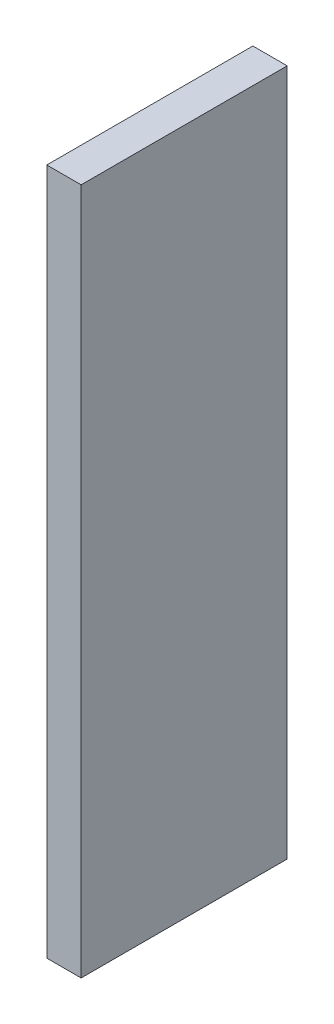
ISO-10303-21;
HEADER;
FILE_DESCRIPTION(('STEP AP214'),'2;1');
FILE_NAME('part.step','',(''),(''),'','','');
FILE_SCHEMA(('AUTOMOTIVE_DESIGN { 1 0 10303 214 1 1 1 1 }'));
ENDSEC;
DATA;
#1=APPLICATION_CONTEXT('core data for automotive mechanical design processes');
#2=APPLICATION_PROTOCOL_DEFINITION('international standard','automotive_design',2000,#1);
#3=PRODUCT_CONTEXT('',#1,'mechanical');
#4=PRODUCT('Part','Part','',(#3));
#5=PRODUCT_RELATED_PRODUCT_CATEGORY('part','',(#4));
#6=PRODUCT_DEFINITION_FORMATION('','',#4);
#7=PRODUCT_DEFINITION_CONTEXT('part definition',#1,'design');
#8=PRODUCT_DEFINITION('design','',#6,#7);
#9=PRODUCT_DEFINITION_SHAPE('','',#8);
#10=(LENGTH_UNIT() NAMED_UNIT(*) SI_UNIT(.MILLI.,.METRE.));
#11=(NAMED_UNIT(*) PLANE_ANGLE_UNIT() SI_UNIT($,.RADIAN.));
#12=(NAMED_UNIT(*) SI_UNIT($,.STERADIAN.) SOLID_ANGLE_UNIT());
#13=UNCERTAINTY_MEASURE_WITH_UNIT(LENGTH_MEASURE(1.E-05),#10,'distance_accuracy_value','');
#14=(GEOMETRIC_REPRESENTATION_CONTEXT(3) GLOBAL_UNCERTAINTY_ASSIGNED_CONTEXT((#13)) GLOBAL_UNIT_ASSIGNED_CONTEXT((#10,
#11,#12)) REPRESENTATION_CONTEXT('',''));
#15=CARTESIAN_POINT('',(0.,0.,0.));
#16=DIRECTION('',(0.,0.,1.));
#17=DIRECTION('',(1.,0.,0.));
#18=AXIS2_PLACEMENT_3D('',#15,#16,#17);
#19=CARTESIAN_POINT('',(-33.3975114201857,953.225914994097,300.));
#20=DIRECTION('',(1.,0.,0.));
#21=DIRECTION('',(0.,1.,0.));
#22=AXIS2_PLACEMENT_3D('',#19,#20,#21);
#23=PLANE('',#22);
#24=DIRECTION('',(0.,-1.,0.));
#25=VECTOR('',#24,1.);
#26=CARTESIAN_POINT('',(-33.3975114201857,953.225914994097,0.));
#27=LINE('',#26,#25);
#28=CARTESIAN_POINT('',(-33.3975114201857,953.225914994097,0.));
#29=VERTEX_POINT('',#28);
#30=CARTESIAN_POINT('',(-33.3975114201856,-46.7740850059032,0.));
#31=VERTEX_POINT('',#30);
#32=EDGE_CURVE('E96',#29,#31,#27,.T.);
#33=ORIENTED_EDGE('',*,*,#32,.T.);
#34=DIRECTION('',(0.,0.,-1.));
#35=VECTOR('',#34,1.);
#36=CARTESIAN_POINT('',(-33.3975114201856,-46.7740850059032,300.));
#37=LINE('',#36,#35);
#38=CARTESIAN_POINT('',(-33.3975114201856,-46.7740850059032,300.));
#39=VERTEX_POINT('',#38);
#40=EDGE_CURVE('E11',#39,#31,#37,.T.);
#41=ORIENTED_EDGE('',*,*,#40,.F.);
#42=DIRECTION('',(0.,-1.,0.));
#43=VECTOR('',#42,1.);
#44=CARTESIAN_POINT('',(-33.3975114201857,953.225914994097,300.));
#45=LINE('',#44,#43);
#46=CARTESIAN_POINT('',(-33.3975114201857,953.225914994097,300.));
#47=VERTEX_POINT('',#46);
#48=EDGE_CURVE('E84',#47,#39,#45,.T.);
#49=ORIENTED_EDGE('',*,*,#48,.F.);
#50=DIRECTION('',(0.,0.,-1.));
#51=VECTOR('',#50,1.);
#52=CARTESIAN_POINT('',(-33.3975114201857,953.225914994097,300.));
#53=LINE('',#52,#51);
#54=EDGE_CURVE('E92',#47,#29,#53,.T.);
#55=ORIENTED_EDGE('',*,*,#54,.T.);
#56=EDGE_LOOP('',(#33,#41,#49,#55));
#57=FACE_BOUND('',#56,.T.);
#58=ADVANCED_FACE('F33',(#57),#23,.F.);
#59=CARTESIAN_POINT('',(-33.3975114201856,-46.7740850059032,300.));
#60=DIRECTION('',(0.,1.,0.));
#61=DIRECTION('',(0.,0.,1.));
#62=AXIS2_PLACEMENT_3D('',#59,#60,#61);
#63=PLANE('',#62);
#64=DIRECTION('',(1.,0.,0.));
#65=VECTOR('',#64,1.);
#66=CARTESIAN_POINT('',(-33.3975114201856,-46.7740850059032,0.));
#67=LINE('',#66,#65);
#68=CARTESIAN_POINT('',(16.6024885798144,-46.7740850059032,0.));
#69=VERTEX_POINT('',#68);
#70=EDGE_CURVE('E88',#31,#69,#67,.T.);
#71=ORIENTED_EDGE('',*,*,#70,.T.);
#72=DIRECTION('',(0.,0.,-1.));
#73=VECTOR('',#72,1.);
#74=CARTESIAN_POINT('',(16.6024885798144,-46.7740850059032,300.));
#75=LINE('',#74,#73);
#76=CARTESIAN_POINT('',(16.6024885798144,-46.7740850059032,300.));
#77=VERTEX_POINT('',#76);
#78=EDGE_CURVE('E41',#77,#69,#75,.T.);
#79=ORIENTED_EDGE('',*,*,#78,.F.);
#80=DIRECTION('',(1.,0.,0.));
#81=VECTOR('',#80,1.);
#82=CARTESIAN_POINT('',(-33.3975114201856,-46.7740850059032,300.));
#83=LINE('',#82,#81);
#84=EDGE_CURVE('E79',#39,#77,#83,.T.);
#85=ORIENTED_EDGE('',*,*,#84,.F.);
#86=ORIENTED_EDGE('',*,*,#40,.T.);
#87=EDGE_LOOP('',(#71,#79,#85,#86));
#88=FACE_BOUND('',#87,.T.);
#89=ADVANCED_FACE('F87',(#88),#63,.F.);
#90=CARTESIAN_POINT('',(16.6024885798143,953.225914994097,300.));
#91=DIRECTION('',(-1.,0.,0.));
#92=DIRECTION('',(0.,-1.,0.));
#93=AXIS2_PLACEMENT_3D('',#90,#91,#92);
#94=PLANE('',#93);
#95=DIRECTION('',(0.,1.,0.));
#96=VECTOR('',#95,1.);
#97=CARTESIAN_POINT('',(16.6024885798143,953.225914994097,0.));
#98=LINE('',#97,#96);
#99=CARTESIAN_POINT('',(16.6024885798143,953.225914994097,0.));
#100=VERTEX_POINT('',#99);
#101=EDGE_CURVE('E66',#69,#100,#98,.T.);
#102=ORIENTED_EDGE('',*,*,#101,.T.);
#103=DIRECTION('',(0.,0.,-1.));
#104=VECTOR('',#103,1.);
#105=CARTESIAN_POINT('',(16.6024885798143,953.225914994097,300.));
#106=LINE('',#105,#104);
#107=CARTESIAN_POINT('',(16.6024885798143,953.225914994097,300.));
#108=VERTEX_POINT('',#107);
#109=EDGE_CURVE('E89',#108,#100,#106,.T.);
#110=ORIENTED_EDGE('',*,*,#109,.F.);
#111=DIRECTION('',(0.,1.,0.));
#112=VECTOR('',#111,1.);
#113=CARTESIAN_POINT('',(16.6024885798143,953.225914994097,300.));
#114=LINE('',#113,#112);
#115=EDGE_CURVE('E82',#77,#108,#114,.T.);
#116=ORIENTED_EDGE('',*,*,#115,.F.);
#117=ORIENTED_EDGE('',*,*,#78,.T.);
#118=EDGE_LOOP('',(#102,#110,#116,#117));
#119=FACE_BOUND('',#118,.T.);
#120=ADVANCED_FACE('F90',(#119),#94,.F.);
#121=CARTESIAN_POINT('',(-33.3975114201857,953.225914994097,300.));
#122=DIRECTION('',(0.,-1.,0.));
#123=DIRECTION('',(0.,0.,-1.));
#124=AXIS2_PLACEMENT_3D('',#121,#122,#123);
#125=PLANE('',#124);
#126=DIRECTION('',(-1.,0.,0.));
#127=VECTOR('',#126,1.);
#128=CARTESIAN_POINT('',(-33.3975114201857,953.225914994097,0.));
#129=LINE('',#128,#127);
#130=EDGE_CURVE('E72',#100,#29,#129,.T.);
#131=ORIENTED_EDGE('',*,*,#130,.T.);
#132=ORIENTED_EDGE('',*,*,#54,.F.);
#133=DIRECTION('',(-1.,0.,0.));
#134=VECTOR('',#133,1.);
#135=CARTESIAN_POINT('',(-33.3975114201857,953.225914994097,300.));
#136=LINE('',#135,#134);
#137=EDGE_CURVE('E49',#108,#47,#136,.T.);
#138=ORIENTED_EDGE('',*,*,#137,.F.);
#139=ORIENTED_EDGE('',*,*,#109,.T.);
#140=EDGE_LOOP('',(#131,#132,#138,#139));
#141=FACE_BOUND('',#140,.T.);
#142=ADVANCED_FACE('F103',(#141),#125,.F.);
#143=CARTESIAN_POINT('',(0.,0.,300.));
#144=DIRECTION('',(0.,0.,1.));
#145=DIRECTION('',(1.,0.,0.));
#146=AXIS2_PLACEMENT_3D('',#143,#144,#145);
#147=PLANE('',#146);
#148=ORIENTED_EDGE('',*,*,#48,.T.);
#149=ORIENTED_EDGE('',*,*,#84,.T.);
#150=ORIENTED_EDGE('',*,*,#115,.T.);
#151=ORIENTED_EDGE('',*,*,#137,.T.);
#152=EDGE_LOOP('',(#148,#149,#150,#151));
#153=FACE_BOUND('',#152,.T.);
#154=ADVANCED_FACE('F80',(#153),#147,.T.);
#155=CARTESIAN_POINT('',(0.,0.,0.));
#156=DIRECTION('',(0.,0.,1.));
#157=DIRECTION('',(1.,0.,0.));
#158=AXIS2_PLACEMENT_3D('',#155,#156,#157);
#159=PLANE('',#158);
#160=ORIENTED_EDGE('',*,*,#32,.F.);
#161=ORIENTED_EDGE('',*,*,#130,.F.);
#162=ORIENTED_EDGE('',*,*,#101,.F.);
#163=ORIENTED_EDGE('',*,*,#70,.F.);
#164=EDGE_LOOP('',(#160,#161,#162,#163));
#165=FACE_BOUND('',#164,.T.);
#166=ADVANCED_FACE('F106',(#165),#159,.F.);
#167=CLOSED_SHELL('',(#58,#89,#120,#142,#154,#166));
#168=MANIFOLD_SOLID_BREP('B2',#167);
#169=ADVANCED_BREP_SHAPE_REPRESENTATION('',(#18,#168),#14);
#170=SHAPE_DEFINITION_REPRESENTATION(#9,#169);
ENDSEC;
END-ISO-10303-21;
